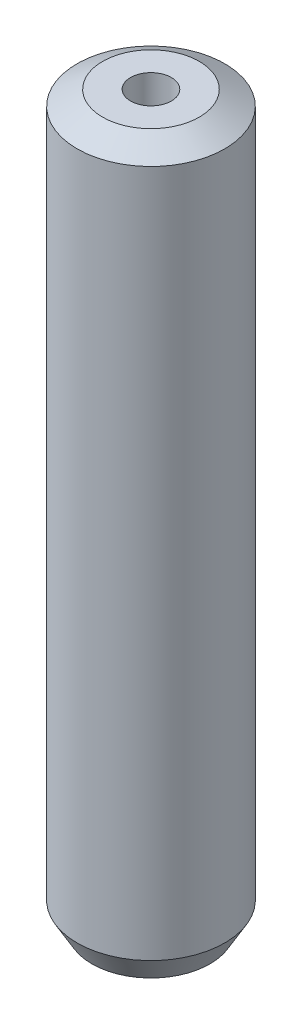
ISO-10303-21;
HEADER;
FILE_DESCRIPTION(('STEP AP214'),'2;1');
FILE_NAME('part.step','',(''),(''),'','','');
FILE_SCHEMA(('AUTOMOTIVE_DESIGN { 1 0 10303 214 1 1 1 1 }'));
ENDSEC;
DATA;
#1=APPLICATION_CONTEXT('core data for automotive mechanical design processes');
#2=APPLICATION_PROTOCOL_DEFINITION('international standard','automotive_design',2000,#1);
#3=PRODUCT_CONTEXT('',#1,'mechanical');
#4=PRODUCT('Part','Part','',(#3));
#5=PRODUCT_RELATED_PRODUCT_CATEGORY('part','',(#4));
#6=PRODUCT_DEFINITION_FORMATION('','',#4);
#7=PRODUCT_DEFINITION_CONTEXT('part definition',#1,'design');
#8=PRODUCT_DEFINITION('design','',#6,#7);
#9=PRODUCT_DEFINITION_SHAPE('','',#8);
#10=(LENGTH_UNIT() NAMED_UNIT(*) SI_UNIT(.MILLI.,.METRE.));
#11=(NAMED_UNIT(*) PLANE_ANGLE_UNIT() SI_UNIT($,.RADIAN.));
#12=(NAMED_UNIT(*) SI_UNIT($,.STERADIAN.) SOLID_ANGLE_UNIT());
#13=UNCERTAINTY_MEASURE_WITH_UNIT(LENGTH_MEASURE(1.E-05),#10,'distance_accuracy_value','');
#14=(GEOMETRIC_REPRESENTATION_CONTEXT(3) GLOBAL_UNCERTAINTY_ASSIGNED_CONTEXT((#13)) GLOBAL_UNIT_ASSIGNED_CONTEXT((#10,
#11,#12)) REPRESENTATION_CONTEXT('',''));
#15=CARTESIAN_POINT('',(0.,0.,0.));
#16=DIRECTION('',(0.,0.,1.));
#17=DIRECTION('',(1.,0.,0.));
#18=AXIS2_PLACEMENT_3D('',#15,#16,#17);
#19=CARTESIAN_POINT('',(0.,73.9692112942428,0.));
#20=DIRECTION('',(0.,-1.,0.));
#21=DIRECTION('',(0.,0.,-1.));
#22=AXIS2_PLACEMENT_3D('',#19,#20,#21);
#23=CYLINDRICAL_SURFACE('',#22,7.5);
#24=CARTESIAN_POINT('',(0.,72.4739258101428,0.));
#25=DIRECTION('',(0.,1.,0.));
#26=DIRECTION('',(0.,0.,1.));
#27=AXIS2_PLACEMENT_3D('',#24,#25,#26);
#28=CIRCLE('',#27,7.5);
#29=CARTESIAN_POINT('',(0.,72.4739258101428,7.5));
#30=VERTEX_POINT('',#29);
#31=EDGE_CURVE('E50',#30,#30,#28,.F.);
#32=ORIENTED_EDGE('',*,*,#31,.T.);
#33=EDGE_LOOP('',(#32));
#34=FACE_BOUND('',#33,.T.);
#35=CARTESIAN_POINT('',(0.,2.58991043028155,0.));
#36=DIRECTION('',(0.,1.,0.));
#37=DIRECTION('',(0.,0.,1.));
#38=AXIS2_PLACEMENT_3D('',#35,#36,#37);
#39=CIRCLE('',#38,7.5);
#40=CARTESIAN_POINT('',(0.,2.58991043028155,7.5));
#41=VERTEX_POINT('',#40);
#42=EDGE_CURVE('E51',#41,#41,#39,.T.);
#43=ORIENTED_EDGE('',*,*,#42,.T.);
#44=EDGE_LOOP('',(#43));
#45=FACE_BOUND('',#44,.T.);
#46=ADVANCED_FACE('F39',(#34,#45),#23,.T.);
#47=CARTESIAN_POINT('',(0.,73.9692112942428,0.));
#48=DIRECTION('',(0.,1.,0.));
#49=DIRECTION('',(0.,0.,1.));
#50=AXIS2_PLACEMENT_3D('',#47,#48,#49);
#51=PLANE('',#50);
#52=CARTESIAN_POINT('',(0.,73.9692112942428,0.));
#53=DIRECTION('',(0.,1.,0.));
#54=DIRECTION('',(0.,0.,1.));
#55=AXIS2_PLACEMENT_3D('',#52,#53,#54);
#56=CIRCLE('',#55,4.91008956971847);
#57=CARTESIAN_POINT('',(0.,73.9692112942428,4.91008956971847));
#58=VERTEX_POINT('',#57);
#59=EDGE_CURVE('E54',#58,#58,#56,.T.);
#60=ORIENTED_EDGE('',*,*,#59,.T.);
#61=EDGE_LOOP('',(#60));
#62=FACE_BOUND('',#61,.T.);
#63=CARTESIAN_POINT('',(0.,73.9692112942428,0.));
#64=DIRECTION('',(0.,1.,0.));
#65=DIRECTION('',(0.,0.,1.));
#66=AXIS2_PLACEMENT_3D('',#63,#64,#65);
#67=CIRCLE('',#66,2.07305361004086);
#68=CARTESIAN_POINT('',(0.,73.9692112942428,2.07305361004086));
#69=VERTEX_POINT('',#68);
#70=EDGE_CURVE('E58',#69,#69,#67,.T.);
#71=ORIENTED_EDGE('',*,*,#70,.F.);
#72=EDGE_LOOP('',(#71));
#73=FACE_BOUND('',#72,.T.);
#74=ADVANCED_FACE('F69',(#62,#73),#51,.T.);
#75=CARTESIAN_POINT('',(0.,0.,0.));
#76=DIRECTION('',(0.,1.,0.));
#77=DIRECTION('',(0.,0.,1.));
#78=AXIS2_PLACEMENT_3D('',#75,#76,#77);
#79=PLANE('',#78);
#80=CARTESIAN_POINT('',(0.,0.,0.));
#81=DIRECTION('',(0.,1.,0.));
#82=DIRECTION('',(0.,0.,1.));
#83=AXIS2_PLACEMENT_3D('',#80,#81,#82);
#84=CIRCLE('',#83,6.00471451589991);
#85=CARTESIAN_POINT('',(0.,0.,6.00471451589991));
#86=VERTEX_POINT('',#85);
#87=EDGE_CURVE('E10',#86,#86,#84,.F.);
#88=ORIENTED_EDGE('',*,*,#87,.T.);
#89=EDGE_LOOP('',(#88));
#90=FACE_BOUND('',#89,.T.);
#91=CARTESIAN_POINT('',(0.,0.,0.));
#92=DIRECTION('',(0.,1.,0.));
#93=DIRECTION('',(0.,0.,1.));
#94=AXIS2_PLACEMENT_3D('',#91,#92,#93);
#95=CIRCLE('',#94,2.07305361004086);
#96=CARTESIAN_POINT('',(0.,0.,2.07305361004086));
#97=VERTEX_POINT('',#96);
#98=EDGE_CURVE('E63',#97,#97,#95,.T.);
#99=ORIENTED_EDGE('',*,*,#98,.T.);
#100=EDGE_LOOP('',(#99));
#101=FACE_BOUND('',#100,.T.);
#102=ADVANCED_FACE('F75',(#90,#101),#79,.F.);
#103=CARTESIAN_POINT('',(0.,73.9692112942428,0.));
#104=DIRECTION('',(0.,-1.,0.));
#105=DIRECTION('',(0.,0.,-1.));
#106=AXIS2_PLACEMENT_3D('',#103,#104,#105);
#107=CYLINDRICAL_SURFACE('',#106,2.07305361004086);
#108=ORIENTED_EDGE('',*,*,#70,.T.);
#109=EDGE_LOOP('',(#108));
#110=FACE_BOUND('',#109,.T.);
#111=ORIENTED_EDGE('',*,*,#98,.F.);
#112=EDGE_LOOP('',(#111));
#113=FACE_BOUND('',#112,.T.);
#114=ADVANCED_FACE('F70',(#110,#113),#107,.F.);
#115=CARTESIAN_POINT('',(0.,73.9692112942428,0.));
#116=DIRECTION('',(0.,-1.,0.));
#117=DIRECTION('',(0.,0.,-1.));
#118=AXIS2_PLACEMENT_3D('',#115,#116,#117);
#119=CONICAL_SURFACE('',#118,4.91008956971847,1.04719755119659);
#120=ORIENTED_EDGE('',*,*,#31,.F.);
#121=EDGE_LOOP('',(#120));
#122=FACE_BOUND('',#121,.T.);
#123=ORIENTED_EDGE('',*,*,#59,.F.);
#124=EDGE_LOOP('',(#123));
#125=FACE_BOUND('',#124,.T.);
#126=ADVANCED_FACE('F81',(#122,#125),#119,.T.);
#127=CARTESIAN_POINT('',(0.,2.58991043028155,0.));
#128=DIRECTION('',(0.,1.,0.));
#129=DIRECTION('',(0.,0.,1.));
#130=AXIS2_PLACEMENT_3D('',#127,#128,#129);
#131=CONICAL_SURFACE('',#130,7.5,0.523598775598303);
#132=ORIENTED_EDGE('',*,*,#87,.F.);
#133=EDGE_LOOP('',(#132));
#134=FACE_BOUND('',#133,.T.);
#135=ORIENTED_EDGE('',*,*,#42,.F.);
#136=EDGE_LOOP('',(#135));
#137=FACE_BOUND('',#136,.T.);
#138=ADVANCED_FACE('F45',(#134,#137),#131,.T.);
#139=CLOSED_SHELL('',(#46,#74,#102,#114,#126,#138));
#140=MANIFOLD_SOLID_BREP('B2',#139);
#141=ADVANCED_BREP_SHAPE_REPRESENTATION('',(#18,#140),#14);
#142=SHAPE_DEFINITION_REPRESENTATION(#9,#141);
ENDSEC;
END-ISO-10303-21;
